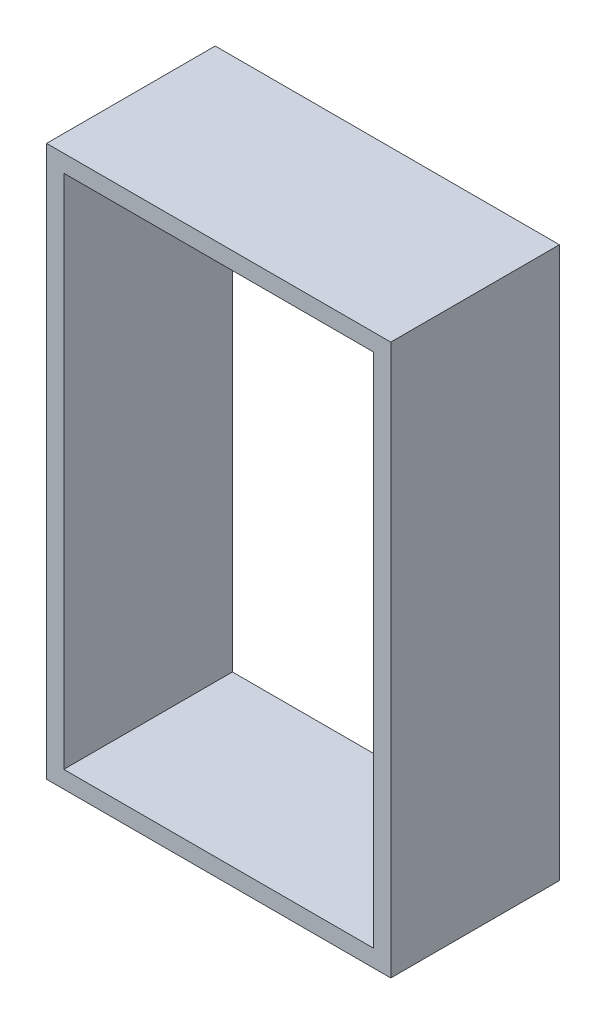
ISO-10303-21;
HEADER;
FILE_DESCRIPTION(('STEP AP214'),'2;1');
FILE_NAME('part.step','',(''),(''),'','','');
FILE_SCHEMA(('AUTOMOTIVE_DESIGN { 1 0 10303 214 1 1 1 1 }'));
ENDSEC;
DATA;
#1=APPLICATION_CONTEXT('core data for automotive mechanical design processes');
#2=APPLICATION_PROTOCOL_DEFINITION('international standard','automotive_design',2000,#1);
#3=PRODUCT_CONTEXT('',#1,'mechanical');
#4=PRODUCT('Part','Part','',(#3));
#5=PRODUCT_RELATED_PRODUCT_CATEGORY('part','',(#4));
#6=PRODUCT_DEFINITION_FORMATION('','',#4);
#7=PRODUCT_DEFINITION_CONTEXT('part definition',#1,'design');
#8=PRODUCT_DEFINITION('design','',#6,#7);
#9=PRODUCT_DEFINITION_SHAPE('','',#8);
#10=(LENGTH_UNIT() NAMED_UNIT(*) SI_UNIT(.MILLI.,.METRE.));
#11=(NAMED_UNIT(*) PLANE_ANGLE_UNIT() SI_UNIT($,.RADIAN.));
#12=(NAMED_UNIT(*) SI_UNIT($,.STERADIAN.) SOLID_ANGLE_UNIT());
#13=UNCERTAINTY_MEASURE_WITH_UNIT(LENGTH_MEASURE(1.E-05),#10,'distance_accuracy_value','');
#14=(GEOMETRIC_REPRESENTATION_CONTEXT(3) GLOBAL_UNCERTAINTY_ASSIGNED_CONTEXT((#13)) GLOBAL_UNIT_ASSIGNED_CONTEXT((#10,
#11,#12)) REPRESENTATION_CONTEXT('',''));
#15=CARTESIAN_POINT('',(0.,0.,0.));
#16=DIRECTION('',(0.,0.,1.));
#17=DIRECTION('',(1.,0.,0.));
#18=AXIS2_PLACEMENT_3D('',#15,#16,#17);
#19=CARTESIAN_POINT('',(0.,0.,62.23));
#20=DIRECTION('',(0.,0.,-1.));
#21=DIRECTION('',(-1.,0.,0.));
#22=AXIS2_PLACEMENT_3D('',#19,#20,#21);
#23=PLANE('',#22);
#24=DIRECTION('',(0.,-1.,0.));
#25=VECTOR('',#24,1.);
#26=CARTESIAN_POINT('',(0.,0.,62.23));
#27=LINE('',#26,#25);
#28=CARTESIAN_POINT('',(0.,203.2,62.23));
#29=VERTEX_POINT('',#28);
#30=CARTESIAN_POINT('',(0.,0.,62.23));
#31=VERTEX_POINT('',#30);
#32=EDGE_CURVE('E134',#29,#31,#27,.T.);
#33=ORIENTED_EDGE('',*,*,#32,.T.);
#34=DIRECTION('',(1.,0.,0.));
#35=VECTOR('',#34,1.);
#36=CARTESIAN_POINT('',(0.,0.,62.23));
#37=LINE('',#36,#35);
#38=CARTESIAN_POINT('',(127.,0.,62.23));
#39=VERTEX_POINT('',#38);
#40=EDGE_CURVE('E137',#31,#39,#37,.T.);
#41=ORIENTED_EDGE('',*,*,#40,.T.);
#42=DIRECTION('',(0.,1.,0.));
#43=VECTOR('',#42,1.);
#44=CARTESIAN_POINT('',(127.,0.,62.23));
#45=LINE('',#44,#43);
#46=CARTESIAN_POINT('',(127.,203.2,62.23));
#47=VERTEX_POINT('',#46);
#48=EDGE_CURVE('E140',#39,#47,#45,.T.);
#49=ORIENTED_EDGE('',*,*,#48,.T.);
#50=DIRECTION('',(-1.,0.,0.));
#51=VECTOR('',#50,1.);
#52=CARTESIAN_POINT('',(0.,203.2,62.23));
#53=LINE('',#52,#51);
#54=EDGE_CURVE('E142',#47,#29,#53,.T.);
#55=ORIENTED_EDGE('',*,*,#54,.T.);
#56=EDGE_LOOP('',(#33,#41,#49,#55));
#57=FACE_BOUND('',#56,.T.);
#58=DIRECTION('',(0.,-1.,0.));
#59=VECTOR('',#58,1.);
#60=CARTESIAN_POINT('',(6.35,6.35,62.23));
#61=LINE('',#60,#59);
#62=CARTESIAN_POINT('',(6.35,196.85,62.23));
#63=VERTEX_POINT('',#62);
#64=CARTESIAN_POINT('',(6.35,6.35,62.23));
#65=VERTEX_POINT('',#64);
#66=EDGE_CURVE('E98',#63,#65,#61,.T.);
#67=ORIENTED_EDGE('',*,*,#66,.F.);
#68=DIRECTION('',(-1.,0.,0.));
#69=VECTOR('',#68,1.);
#70=CARTESIAN_POINT('',(6.35,196.85,62.23));
#71=LINE('',#70,#69);
#72=CARTESIAN_POINT('',(120.65,196.85,62.23));
#73=VERTEX_POINT('',#72);
#74=EDGE_CURVE('E120',#73,#63,#71,.T.);
#75=ORIENTED_EDGE('',*,*,#74,.F.);
#76=DIRECTION('',(0.,1.,0.));
#77=VECTOR('',#76,1.);
#78=CARTESIAN_POINT('',(120.65,6.35,62.23));
#79=LINE('',#78,#77);
#80=CARTESIAN_POINT('',(120.65,6.35,62.23));
#81=VERTEX_POINT('',#80);
#82=EDGE_CURVE('E118',#81,#73,#79,.T.);
#83=ORIENTED_EDGE('',*,*,#82,.F.);
#84=DIRECTION('',(1.,0.,0.));
#85=VECTOR('',#84,1.);
#86=CARTESIAN_POINT('',(6.35,6.35,62.23));
#87=LINE('',#86,#85);
#88=EDGE_CURVE('E106',#65,#81,#87,.T.);
#89=ORIENTED_EDGE('',*,*,#88,.F.);
#90=EDGE_LOOP('',(#67,#75,#83,#89));
#91=FACE_BOUND('',#90,.T.);
#92=ADVANCED_FACE('F33',(#57,#91),#23,.F.);
#93=CARTESIAN_POINT('',(0.,0.,0.));
#94=DIRECTION('',(0.,0.,-1.));
#95=DIRECTION('',(-1.,0.,0.));
#96=AXIS2_PLACEMENT_3D('',#93,#94,#95);
#97=PLANE('',#96);
#98=DIRECTION('',(0.,-1.,0.));
#99=VECTOR('',#98,1.);
#100=CARTESIAN_POINT('',(0.,0.,0.));
#101=LINE('',#100,#99);
#102=CARTESIAN_POINT('',(0.,203.2,0.));
#103=VERTEX_POINT('',#102);
#104=CARTESIAN_POINT('',(0.,0.,0.));
#105=VERTEX_POINT('',#104);
#106=EDGE_CURVE('E114',#103,#105,#101,.T.);
#107=ORIENTED_EDGE('',*,*,#106,.F.);
#108=DIRECTION('',(-1.,0.,0.));
#109=VECTOR('',#108,1.);
#110=CARTESIAN_POINT('',(0.,203.2,0.));
#111=LINE('',#110,#109);
#112=CARTESIAN_POINT('',(127.,203.2,0.));
#113=VERTEX_POINT('',#112);
#114=EDGE_CURVE('E138',#113,#103,#111,.T.);
#115=ORIENTED_EDGE('',*,*,#114,.F.);
#116=DIRECTION('',(0.,1.,0.));
#117=VECTOR('',#116,1.);
#118=CARTESIAN_POINT('',(127.,0.,0.));
#119=LINE('',#118,#117);
#120=CARTESIAN_POINT('',(127.,0.,0.));
#121=VERTEX_POINT('',#120);
#122=EDGE_CURVE('E149',#121,#113,#119,.T.);
#123=ORIENTED_EDGE('',*,*,#122,.F.);
#124=DIRECTION('',(1.,0.,0.));
#125=VECTOR('',#124,1.);
#126=CARTESIAN_POINT('',(0.,0.,0.));
#127=LINE('',#126,#125);
#128=EDGE_CURVE('E147',#105,#121,#127,.T.);
#129=ORIENTED_EDGE('',*,*,#128,.F.);
#130=EDGE_LOOP('',(#107,#115,#123,#129));
#131=FACE_BOUND('',#130,.T.);
#132=DIRECTION('',(-1.,0.,0.));
#133=VECTOR('',#132,1.);
#134=CARTESIAN_POINT('',(6.35,196.85,0.));
#135=LINE('',#134,#133);
#136=CARTESIAN_POINT('',(120.65,196.85,0.));
#137=VERTEX_POINT('',#136);
#138=CARTESIAN_POINT('',(6.35,196.85,0.));
#139=VERTEX_POINT('',#138);
#140=EDGE_CURVE('E107',#137,#139,#135,.T.);
#141=ORIENTED_EDGE('',*,*,#140,.T.);
#142=DIRECTION('',(0.,-1.,0.));
#143=VECTOR('',#142,1.);
#144=CARTESIAN_POINT('',(6.35,6.35,0.));
#145=LINE('',#144,#143);
#146=CARTESIAN_POINT('',(6.35,6.35,0.));
#147=VERTEX_POINT('',#146);
#148=EDGE_CURVE('E56',#139,#147,#145,.T.);
#149=ORIENTED_EDGE('',*,*,#148,.T.);
#150=DIRECTION('',(1.,0.,0.));
#151=VECTOR('',#150,1.);
#152=CARTESIAN_POINT('',(6.35,6.35,0.));
#153=LINE('',#152,#151);
#154=CARTESIAN_POINT('',(120.65,6.35,0.));
#155=VERTEX_POINT('',#154);
#156=EDGE_CURVE('E113',#147,#155,#153,.T.);
#157=ORIENTED_EDGE('',*,*,#156,.T.);
#158=DIRECTION('',(0.,1.,0.));
#159=VECTOR('',#158,1.);
#160=CARTESIAN_POINT('',(120.65,6.35,0.));
#161=LINE('',#160,#159);
#162=EDGE_CURVE('E126',#155,#137,#161,.T.);
#163=ORIENTED_EDGE('',*,*,#162,.T.);
#164=EDGE_LOOP('',(#141,#149,#157,#163));
#165=FACE_BOUND('',#164,.T.);
#166=ADVANCED_FACE('F167',(#131,#165),#97,.T.);
#167=CARTESIAN_POINT('',(0.,0.,62.23));
#168=DIRECTION('',(1.,0.,0.));
#169=DIRECTION('',(0.,0.,-1.));
#170=AXIS2_PLACEMENT_3D('',#167,#168,#169);
#171=PLANE('',#170);
#172=ORIENTED_EDGE('',*,*,#106,.T.);
#173=DIRECTION('',(0.,0.,-1.));
#174=VECTOR('',#173,1.);
#175=CARTESIAN_POINT('',(0.,0.,62.23));
#176=LINE('',#175,#174);
#177=EDGE_CURVE('E11',#31,#105,#176,.T.);
#178=ORIENTED_EDGE('',*,*,#177,.F.);
#179=ORIENTED_EDGE('',*,*,#32,.F.);
#180=DIRECTION('',(0.,0.,-1.));
#181=VECTOR('',#180,1.);
#182=CARTESIAN_POINT('',(0.,203.2,62.23));
#183=LINE('',#182,#181);
#184=EDGE_CURVE('E144',#29,#103,#183,.T.);
#185=ORIENTED_EDGE('',*,*,#184,.T.);
#186=EDGE_LOOP('',(#172,#178,#179,#185));
#187=FACE_BOUND('',#186,.T.);
#188=ADVANCED_FACE('F35',(#187),#171,.F.);
#189=CARTESIAN_POINT('',(0.,0.,62.23));
#190=DIRECTION('',(0.,1.,0.));
#191=DIRECTION('',(0.,0.,1.));
#192=AXIS2_PLACEMENT_3D('',#189,#190,#191);
#193=PLANE('',#192);
#194=ORIENTED_EDGE('',*,*,#128,.T.);
#195=DIRECTION('',(0.,0.,-1.));
#196=VECTOR('',#195,1.);
#197=CARTESIAN_POINT('',(127.,0.,62.23));
#198=LINE('',#197,#196);
#199=EDGE_CURVE('E41',#39,#121,#198,.T.);
#200=ORIENTED_EDGE('',*,*,#199,.F.);
#201=ORIENTED_EDGE('',*,*,#40,.F.);
#202=ORIENTED_EDGE('',*,*,#177,.T.);
#203=EDGE_LOOP('',(#194,#200,#201,#202));
#204=FACE_BOUND('',#203,.T.);
#205=ADVANCED_FACE('F177',(#204),#193,.F.);
#206=CARTESIAN_POINT('',(127.,0.,62.23));
#207=DIRECTION('',(-1.,0.,0.));
#208=DIRECTION('',(0.,0.,1.));
#209=AXIS2_PLACEMENT_3D('',#206,#207,#208);
#210=PLANE('',#209);
#211=ORIENTED_EDGE('',*,*,#122,.T.);
#212=DIRECTION('',(0.,0.,-1.));
#213=VECTOR('',#212,1.);
#214=CARTESIAN_POINT('',(127.,203.2,62.23));
#215=LINE('',#214,#213);
#216=EDGE_CURVE('E154',#47,#113,#215,.T.);
#217=ORIENTED_EDGE('',*,*,#216,.F.);
#218=ORIENTED_EDGE('',*,*,#48,.F.);
#219=ORIENTED_EDGE('',*,*,#199,.T.);
#220=EDGE_LOOP('',(#211,#217,#218,#219));
#221=FACE_BOUND('',#220,.T.);
#222=ADVANCED_FACE('F161',(#221),#210,.F.);
#223=CARTESIAN_POINT('',(0.,203.2,62.23));
#224=DIRECTION('',(0.,-1.,0.));
#225=DIRECTION('',(0.,0.,-1.));
#226=AXIS2_PLACEMENT_3D('',#223,#224,#225);
#227=PLANE('',#226);
#228=ORIENTED_EDGE('',*,*,#114,.T.);
#229=ORIENTED_EDGE('',*,*,#184,.F.);
#230=ORIENTED_EDGE('',*,*,#54,.F.);
#231=ORIENTED_EDGE('',*,*,#216,.T.);
#232=EDGE_LOOP('',(#228,#229,#230,#231));
#233=FACE_BOUND('',#232,.T.);
#234=ADVANCED_FACE('F171',(#233),#227,.F.);
#235=CARTESIAN_POINT('',(6.35,6.35,62.23));
#236=DIRECTION('',(1.,0.,0.));
#237=DIRECTION('',(0.,0.,-1.));
#238=AXIS2_PLACEMENT_3D('',#235,#236,#237);
#239=PLANE('',#238);
#240=ORIENTED_EDGE('',*,*,#148,.F.);
#241=DIRECTION('',(0.,0.,-1.));
#242=VECTOR('',#241,1.);
#243=CARTESIAN_POINT('',(6.35,196.85,62.23));
#244=LINE('',#243,#242);
#245=EDGE_CURVE('E102',#63,#139,#244,.T.);
#246=ORIENTED_EDGE('',*,*,#245,.F.);
#247=ORIENTED_EDGE('',*,*,#66,.T.);
#248=DIRECTION('',(0.,0.,-1.));
#249=VECTOR('',#248,1.);
#250=CARTESIAN_POINT('',(6.35,6.35,62.23));
#251=LINE('',#250,#249);
#252=EDGE_CURVE('E101',#65,#147,#251,.T.);
#253=ORIENTED_EDGE('',*,*,#252,.T.);
#254=EDGE_LOOP('',(#240,#246,#247,#253));
#255=FACE_BOUND('',#254,.T.);
#256=ADVANCED_FACE('F100',(#255),#239,.T.);
#257=CARTESIAN_POINT('',(6.35,6.35,62.23));
#258=DIRECTION('',(0.,1.,0.));
#259=DIRECTION('',(0.,0.,1.));
#260=AXIS2_PLACEMENT_3D('',#257,#258,#259);
#261=PLANE('',#260);
#262=ORIENTED_EDGE('',*,*,#156,.F.);
#263=ORIENTED_EDGE('',*,*,#252,.F.);
#264=ORIENTED_EDGE('',*,*,#88,.T.);
#265=DIRECTION('',(0.,0.,-1.));
#266=VECTOR('',#265,1.);
#267=CARTESIAN_POINT('',(120.65,6.35,62.23));
#268=LINE('',#267,#266);
#269=EDGE_CURVE('E115',#81,#155,#268,.T.);
#270=ORIENTED_EDGE('',*,*,#269,.T.);
#271=EDGE_LOOP('',(#262,#263,#264,#270));
#272=FACE_BOUND('',#271,.T.);
#273=ADVANCED_FACE('F110',(#272),#261,.T.);
#274=CARTESIAN_POINT('',(120.65,6.35,62.23));
#275=DIRECTION('',(-1.,0.,0.));
#276=DIRECTION('',(0.,0.,1.));
#277=AXIS2_PLACEMENT_3D('',#274,#275,#276);
#278=PLANE('',#277);
#279=ORIENTED_EDGE('',*,*,#162,.F.);
#280=ORIENTED_EDGE('',*,*,#269,.F.);
#281=ORIENTED_EDGE('',*,*,#82,.T.);
#282=DIRECTION('',(0.,0.,-1.));
#283=VECTOR('',#282,1.);
#284=CARTESIAN_POINT('',(120.65,196.85,62.23));
#285=LINE('',#284,#283);
#286=EDGE_CURVE('E48',#73,#137,#285,.T.);
#287=ORIENTED_EDGE('',*,*,#286,.T.);
#288=EDGE_LOOP('',(#279,#280,#281,#287));
#289=FACE_BOUND('',#288,.T.);
#290=ADVANCED_FACE('F200',(#289),#278,.T.);
#291=CARTESIAN_POINT('',(6.35,196.85,62.23));
#292=DIRECTION('',(0.,-1.,0.));
#293=DIRECTION('',(0.,0.,-1.));
#294=AXIS2_PLACEMENT_3D('',#291,#292,#293);
#295=PLANE('',#294);
#296=ORIENTED_EDGE('',*,*,#140,.F.);
#297=ORIENTED_EDGE('',*,*,#286,.F.);
#298=ORIENTED_EDGE('',*,*,#74,.T.);
#299=ORIENTED_EDGE('',*,*,#245,.T.);
#300=EDGE_LOOP('',(#296,#297,#298,#299));
#301=FACE_BOUND('',#300,.T.);
#302=ADVANCED_FACE('F204',(#301),#295,.T.);
#303=CLOSED_SHELL('',(#92,#166,#188,#205,#222,#234,#256,#273,#290,#302));
#304=MANIFOLD_SOLID_BREP('B2',#303);
#305=ADVANCED_BREP_SHAPE_REPRESENTATION('',(#18,#304),#14);
#306=SHAPE_DEFINITION_REPRESENTATION(#9,#305);
ENDSEC;
END-ISO-10303-21;
